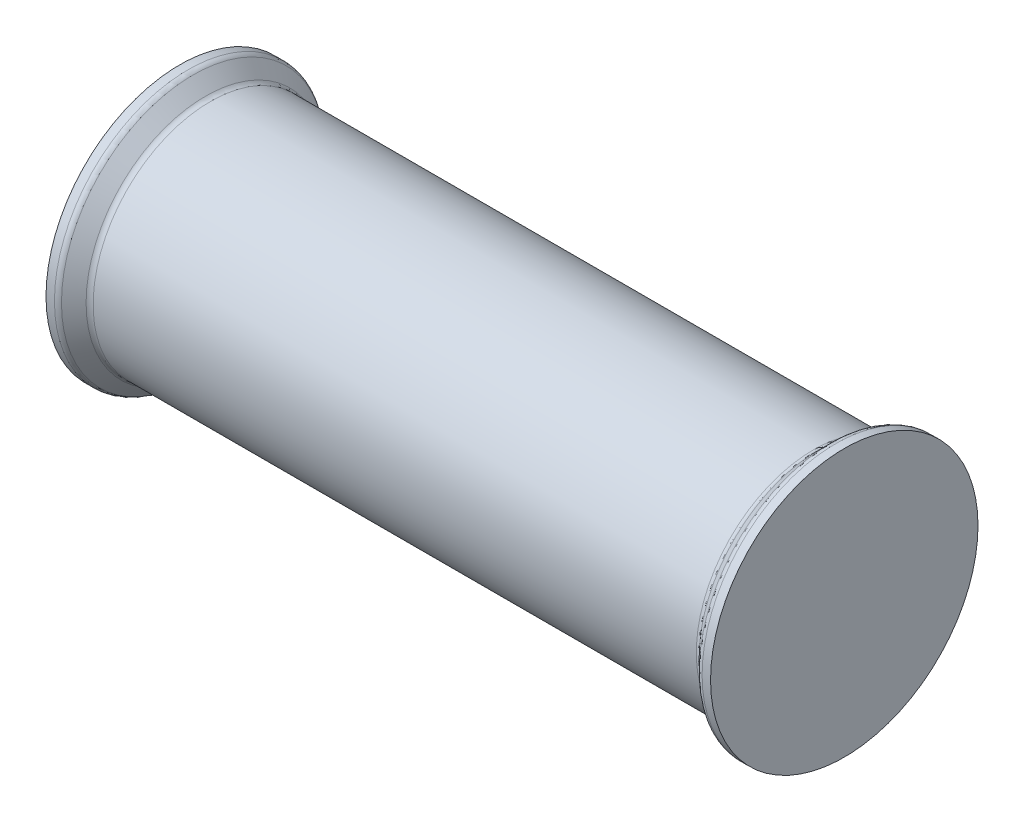
ISO-10303-21;
HEADER;
FILE_DESCRIPTION(('STEP AP214'),'2;1');
FILE_NAME('part.step','',(''),(''),'','','');
FILE_SCHEMA(('AUTOMOTIVE_DESIGN { 1 0 10303 214 1 1 1 1 }'));
ENDSEC;
DATA;
#1=APPLICATION_CONTEXT('core data for automotive mechanical design processes');
#2=APPLICATION_PROTOCOL_DEFINITION('international standard','automotive_design',2000,#1);
#3=PRODUCT_CONTEXT('',#1,'mechanical');
#4=PRODUCT('Part','Part','',(#3));
#5=PRODUCT_RELATED_PRODUCT_CATEGORY('part','',(#4));
#6=PRODUCT_DEFINITION_FORMATION('','',#4);
#7=PRODUCT_DEFINITION_CONTEXT('part definition',#1,'design');
#8=PRODUCT_DEFINITION('design','',#6,#7);
#9=PRODUCT_DEFINITION_SHAPE('','',#8);
#10=(LENGTH_UNIT() NAMED_UNIT(*) SI_UNIT(.MILLI.,.METRE.));
#11=(NAMED_UNIT(*) PLANE_ANGLE_UNIT() SI_UNIT($,.RADIAN.));
#12=(NAMED_UNIT(*) SI_UNIT($,.STERADIAN.) SOLID_ANGLE_UNIT());
#13=UNCERTAINTY_MEASURE_WITH_UNIT(LENGTH_MEASURE(1.E-05),#10,'distance_accuracy_value','');
#14=(GEOMETRIC_REPRESENTATION_CONTEXT(3) GLOBAL_UNCERTAINTY_ASSIGNED_CONTEXT((#13)) GLOBAL_UNIT_ASSIGNED_CONTEXT((#10,
#11,#12)) REPRESENTATION_CONTEXT('',''));
#15=CARTESIAN_POINT('',(0.,0.,0.));
#16=DIRECTION('',(0.,0.,1.));
#17=DIRECTION('',(1.,0.,0.));
#18=AXIS2_PLACEMENT_3D('',#15,#16,#17);
#19=CARTESIAN_POINT('',(-142.,-57.,0.));
#20=DIRECTION('',(1.,0.,0.));
#21=DIRECTION('',(0.,0.,-1.));
#22=AXIS2_PLACEMENT_3D('',#19,#20,#21);
#23=PLANE('',#22);
#24=CARTESIAN_POINT('',(-142.,0.,0.));
#25=DIRECTION('',(1.,0.,0.));
#26=DIRECTION('',(0.,0.,-1.));
#27=AXIS2_PLACEMENT_3D('',#24,#25,#26);
#28=CIRCLE('',#27,57.15);
#29=CARTESIAN_POINT('',(-142.,0.,-57.15));
#30=VERTEX_POINT('',#29);
#31=EDGE_CURVE('E17',#30,#30,#28,.T.);
#32=ORIENTED_EDGE('',*,*,#31,.F.);
#33=EDGE_LOOP('',(#32));
#34=FACE_BOUND('',#33,.T.);
#35=ADVANCED_FACE('F14',(#34),#23,.F.);
#36=CARTESIAN_POINT('',(142.,-57.,0.));
#37=DIRECTION('',(-1.,0.,0.));
#38=DIRECTION('',(0.,0.,1.));
#39=AXIS2_PLACEMENT_3D('',#36,#37,#38);
#40=PLANE('',#39);
#41=CARTESIAN_POINT('',(142.,0.,0.));
#42=DIRECTION('',(1.,0.,0.));
#43=DIRECTION('',(0.,0.,-1.));
#44=AXIS2_PLACEMENT_3D('',#41,#42,#43);
#45=CIRCLE('',#44,57.15);
#46=CARTESIAN_POINT('',(142.,0.,-57.15));
#47=VERTEX_POINT('',#46);
#48=EDGE_CURVE('E153',#47,#47,#45,.F.);
#49=ORIENTED_EDGE('',*,*,#48,.F.);
#50=EDGE_LOOP('',(#49));
#51=FACE_BOUND('',#50,.T.);
#52=ADVANCED_FACE('F77',(#51),#40,.F.);
#53=CARTESIAN_POINT('',(0.,0.,0.));
#54=DIRECTION('',(1.,0.,0.));
#55=DIRECTION('',(0.,0.,-1.));
#56=AXIS2_PLACEMENT_3D('',#53,#54,#55);
#57=CYLINDRICAL_SURFACE('',#56,57.15);
#58=CARTESIAN_POINT('',(-138.392640687119,0.,0.));
#59=DIRECTION('',(-1.,0.,0.));
#60=DIRECTION('',(0.,0.,1.));
#61=AXIS2_PLACEMENT_3D('',#58,#59,#60);
#62=CIRCLE('',#61,57.15);
#63=CARTESIAN_POINT('',(-138.392640687119,0.,57.15));
#64=VERTEX_POINT('',#63);
#65=EDGE_CURVE('E154',#64,#64,#62,.F.);
#66=ORIENTED_EDGE('',*,*,#65,.F.);
#67=EDGE_LOOP('',(#66));
#68=FACE_BOUND('',#67,.T.);
#69=ORIENTED_EDGE('',*,*,#31,.T.);
#70=EDGE_LOOP('',(#69));
#71=FACE_BOUND('',#70,.T.);
#72=ADVANCED_FACE('F74',(#68,#71),#57,.T.);
#73=CARTESIAN_POINT('',(0.,0.,0.));
#74=DIRECTION('',(1.,0.,0.));
#75=DIRECTION('',(0.,0.,-1.));
#76=AXIS2_PLACEMENT_3D('',#73,#74,#75);
#77=CYLINDRICAL_SURFACE('',#76,57.15);
#78=ORIENTED_EDGE('',*,*,#48,.T.);
#79=EDGE_LOOP('',(#78));
#80=FACE_BOUND('',#79,.T.);
#81=CARTESIAN_POINT('',(138.392640687119,0.,0.));
#82=DIRECTION('',(1.,0.,0.));
#83=DIRECTION('',(0.,0.,-1.));
#84=AXIS2_PLACEMENT_3D('',#81,#82,#83);
#85=CIRCLE('',#84,57.15);
#86=CARTESIAN_POINT('',(138.392640687119,0.,-57.15));
#87=VERTEX_POINT('',#86);
#88=EDGE_CURVE('E56',#87,#87,#85,.F.);
#89=ORIENTED_EDGE('',*,*,#88,.F.);
#90=EDGE_LOOP('',(#89));
#91=FACE_BOUND('',#90,.T.);
#92=ADVANCED_FACE('F70',(#80,#91),#77,.T.);
#93=CARTESIAN_POINT('',(-138.392640687119,0.,0.));
#94=DIRECTION('',(-1.,0.,0.));
#95=DIRECTION('',(0.,0.,1.));
#96=AXIS2_PLACEMENT_3D('',#93,#94,#95);
#97=TOROIDAL_SURFACE('',#96,54.15,3.);
#98=ORIENTED_EDGE('',*,*,#65,.T.);
#99=EDGE_LOOP('',(#98));
#100=FACE_BOUND('',#99,.T.);
#101=CARTESIAN_POINT('',(-136.27132034356,0.,0.));
#102=DIRECTION('',(-1.,0.,0.));
#103=DIRECTION('',(0.,0.,1.));
#104=AXIS2_PLACEMENT_3D('',#101,#102,#103);
#105=CIRCLE('',#104,56.2713203435596);
#106=CARTESIAN_POINT('',(-136.27132034356,0.,56.2713203435596));
#107=VERTEX_POINT('',#106);
#108=EDGE_CURVE('E53',#107,#107,#105,.F.);
#109=ORIENTED_EDGE('',*,*,#108,.F.);
#110=EDGE_LOOP('',(#109));
#111=FACE_BOUND('',#110,.T.);
#112=ADVANCED_FACE('F66',(#100,#111),#97,.T.);
#113=CARTESIAN_POINT('',(138.392640687119,0.,0.));
#114=DIRECTION('',(1.,0.,0.));
#115=DIRECTION('',(0.,0.,-1.));
#116=AXIS2_PLACEMENT_3D('',#113,#114,#115);
#117=TOROIDAL_SURFACE('',#116,54.15,3.);
#118=ORIENTED_EDGE('',*,*,#88,.T.);
#119=EDGE_LOOP('',(#118));
#120=FACE_BOUND('',#119,.T.);
#121=CARTESIAN_POINT('',(136.27132034356,0.,0.));
#122=DIRECTION('',(1.,0.,0.));
#123=DIRECTION('',(0.,0.,-1.));
#124=AXIS2_PLACEMENT_3D('',#121,#122,#123);
#125=CIRCLE('',#124,56.2713203435596);
#126=CARTESIAN_POINT('',(136.27132034356,0.,-56.2713203435596));
#127=VERTEX_POINT('',#126);
#128=EDGE_CURVE('E50',#127,#127,#125,.F.);
#129=ORIENTED_EDGE('',*,*,#128,.F.);
#130=EDGE_LOOP('',(#129));
#131=FACE_BOUND('',#130,.T.);
#132=ADVANCED_FACE('F62',(#120,#131),#117,.T.);
#133=CARTESIAN_POINT('',(-136.27132034356,0.,0.));
#134=DIRECTION('',(-1.,0.,0.));
#135=DIRECTION('',(0.,0.,1.));
#136=AXIS2_PLACEMENT_3D('',#133,#134,#135);
#137=CONICAL_SURFACE('',#136,56.2713203435596,0.78539816339745);
#138=ORIENTED_EDGE('',*,*,#108,.T.);
#139=EDGE_LOOP('',(#138));
#140=FACE_BOUND('',#139,.T.);
#141=CARTESIAN_POINT('',(-131.00867965644,0.,0.));
#142=DIRECTION('',(1.,0.,0.));
#143=DIRECTION('',(0.,0.,-1.));
#144=AXIS2_PLACEMENT_3D('',#141,#142,#143);
#145=CIRCLE('',#144,51.0086796564404);
#146=CARTESIAN_POINT('',(-131.00867965644,0.,-51.0086796564404));
#147=VERTEX_POINT('',#146);
#148=EDGE_CURVE('E47',#147,#147,#145,.F.);
#149=ORIENTED_EDGE('',*,*,#148,.T.);
#150=EDGE_LOOP('',(#149));
#151=FACE_BOUND('',#150,.T.);
#152=ADVANCED_FACE('F65',(#140,#151),#137,.T.);
#153=CARTESIAN_POINT('',(136.27132034356,0.,0.));
#154=DIRECTION('',(1.,0.,0.));
#155=DIRECTION('',(0.,0.,-1.));
#156=AXIS2_PLACEMENT_3D('',#153,#154,#155);
#157=CONICAL_SURFACE('',#156,56.2713203435596,0.78539816339745);
#158=ORIENTED_EDGE('',*,*,#128,.T.);
#159=EDGE_LOOP('',(#158));
#160=FACE_BOUND('',#159,.T.);
#161=CARTESIAN_POINT('',(131.00867965644,0.,0.));
#162=DIRECTION('',(1.,0.,0.));
#163=DIRECTION('',(0.,0.,-1.));
#164=AXIS2_PLACEMENT_3D('',#161,#162,#163);
#165=CIRCLE('',#164,51.0086796564404);
#166=CARTESIAN_POINT('',(131.00867965644,0.,-51.0086796564404));
#167=VERTEX_POINT('',#166);
#168=EDGE_CURVE('E26',#167,#167,#165,.T.);
#169=ORIENTED_EDGE('',*,*,#168,.T.);
#170=EDGE_LOOP('',(#169));
#171=FACE_BOUND('',#170,.T.);
#172=ADVANCED_FACE('F42',(#160,#171),#157,.T.);
#173=CARTESIAN_POINT('',(-128.887359312881,0.,0.));
#174=DIRECTION('',(1.,0.,0.));
#175=DIRECTION('',(0.,0.,-1.));
#176=AXIS2_PLACEMENT_3D('',#173,#174,#175);
#177=TOROIDAL_SURFACE('',#176,53.13,3.);
#178=CARTESIAN_POINT('',(-128.887359312881,0.,0.));
#179=DIRECTION('',(1.,0.,0.));
#180=DIRECTION('',(0.,0.,-1.));
#181=AXIS2_PLACEMENT_3D('',#178,#179,#180);
#182=CIRCLE('',#181,50.13);
#183=CARTESIAN_POINT('',(-128.887359312881,0.,-50.13));
#184=VERTEX_POINT('',#183);
#185=EDGE_CURVE('E21',#184,#184,#182,.T.);
#186=ORIENTED_EDGE('',*,*,#185,.F.);
#187=EDGE_LOOP('',(#186));
#188=FACE_BOUND('',#187,.T.);
#189=ORIENTED_EDGE('',*,*,#148,.F.);
#190=EDGE_LOOP('',(#189));
#191=FACE_BOUND('',#190,.T.);
#192=ADVANCED_FACE('F38',(#188,#191),#177,.F.);
#193=CARTESIAN_POINT('',(128.887359312881,0.,0.));
#194=DIRECTION('',(1.,0.,0.));
#195=DIRECTION('',(0.,0.,-1.));
#196=AXIS2_PLACEMENT_3D('',#193,#194,#195);
#197=TOROIDAL_SURFACE('',#196,53.13,3.);
#198=ORIENTED_EDGE('',*,*,#168,.F.);
#199=EDGE_LOOP('',(#198));
#200=FACE_BOUND('',#199,.T.);
#201=CARTESIAN_POINT('',(128.887359312881,0.,0.));
#202=DIRECTION('',(1.,0.,0.));
#203=DIRECTION('',(0.,0.,-1.));
#204=AXIS2_PLACEMENT_3D('',#201,#202,#203);
#205=CIRCLE('',#204,50.13);
#206=CARTESIAN_POINT('',(128.887359312881,0.,-50.13));
#207=VERTEX_POINT('',#206);
#208=EDGE_CURVE('E10',#207,#207,#205,.F.);
#209=ORIENTED_EDGE('',*,*,#208,.F.);
#210=EDGE_LOOP('',(#209));
#211=FACE_BOUND('',#210,.T.);
#212=ADVANCED_FACE('F33',(#200,#211),#197,.F.);
#213=CARTESIAN_POINT('',(0.,0.,0.));
#214=DIRECTION('',(1.,0.,0.));
#215=DIRECTION('',(0.,0.,-1.));
#216=AXIS2_PLACEMENT_3D('',#213,#214,#215);
#217=CYLINDRICAL_SURFACE('',#216,50.13);
#218=ORIENTED_EDGE('',*,*,#208,.T.);
#219=EDGE_LOOP('',(#218));
#220=FACE_BOUND('',#219,.T.);
#221=ORIENTED_EDGE('',*,*,#185,.T.);
#222=EDGE_LOOP('',(#221));
#223=FACE_BOUND('',#222,.T.);
#224=ADVANCED_FACE('F37',(#220,#223),#217,.T.);
#225=CLOSED_SHELL('',(#35,#52,#72,#92,#112,#132,#152,#172,#192,#212,#224));
#226=MANIFOLD_SOLID_BREP('B1',#225);
#227=ADVANCED_BREP_SHAPE_REPRESENTATION('',(#18,#226),#14);
#228=SHAPE_DEFINITION_REPRESENTATION(#9,#227);
ENDSEC;
END-ISO-10303-21;
